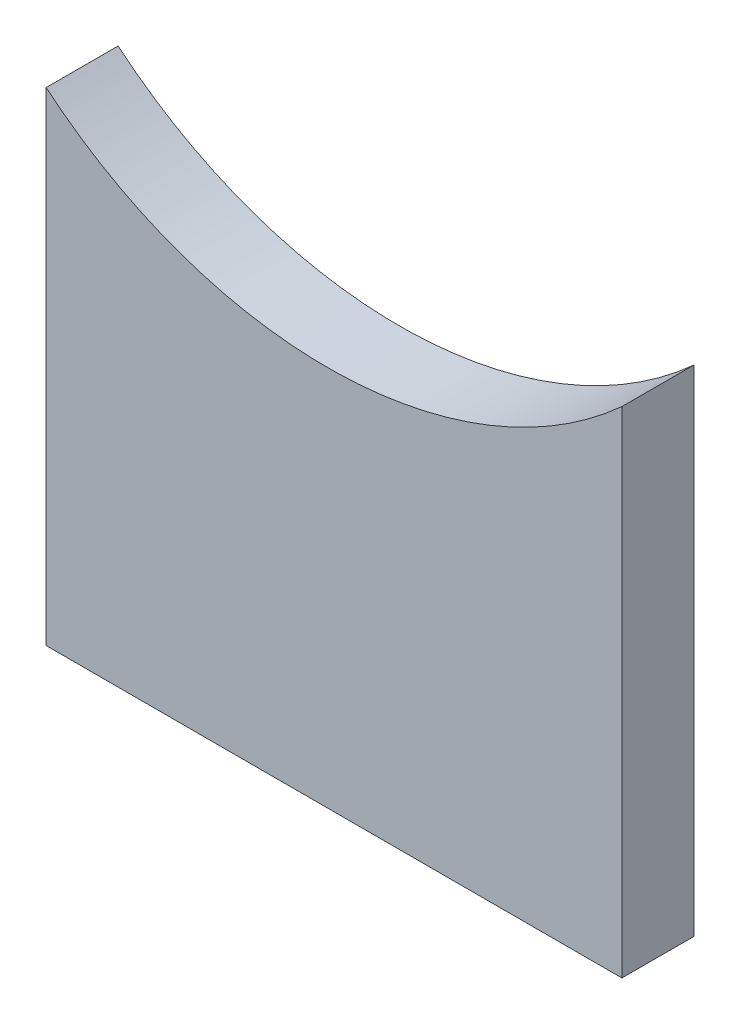
ISO-10303-21;
HEADER;
FILE_DESCRIPTION(('STEP AP214'),'2;1');
FILE_NAME('part.step','',(''),(''),'','','');
FILE_SCHEMA(('AUTOMOTIVE_DESIGN { 1 0 10303 214 1 1 1 1 }'));
ENDSEC;
DATA;
#1=APPLICATION_CONTEXT('core data for automotive mechanical design processes');
#2=APPLICATION_PROTOCOL_DEFINITION('international standard','automotive_design',2000,#1);
#3=PRODUCT_CONTEXT('',#1,'mechanical');
#4=PRODUCT('Part','Part','',(#3));
#5=PRODUCT_RELATED_PRODUCT_CATEGORY('part','',(#4));
#6=PRODUCT_DEFINITION_FORMATION('','',#4);
#7=PRODUCT_DEFINITION_CONTEXT('part definition',#1,'design');
#8=PRODUCT_DEFINITION('design','',#6,#7);
#9=PRODUCT_DEFINITION_SHAPE('','',#8);
#10=(LENGTH_UNIT() NAMED_UNIT(*) SI_UNIT(.MILLI.,.METRE.));
#11=(NAMED_UNIT(*) PLANE_ANGLE_UNIT() SI_UNIT($,.RADIAN.));
#12=(NAMED_UNIT(*) SI_UNIT($,.STERADIAN.) SOLID_ANGLE_UNIT());
#13=UNCERTAINTY_MEASURE_WITH_UNIT(LENGTH_MEASURE(1.E-05),#10,'distance_accuracy_value','');
#14=(GEOMETRIC_REPRESENTATION_CONTEXT(3) GLOBAL_UNCERTAINTY_ASSIGNED_CONTEXT((#13)) GLOBAL_UNIT_ASSIGNED_CONTEXT((#10,
#11,#12)) REPRESENTATION_CONTEXT('',''));
#15=CARTESIAN_POINT('',(0.,0.,0.));
#16=DIRECTION('',(0.,0.,1.));
#17=DIRECTION('',(1.,0.,0.));
#18=AXIS2_PLACEMENT_3D('',#15,#16,#17);
#19=CARTESIAN_POINT('',(-6.29704621779584E-13,0.,2.));
#20=DIRECTION('',(1.,0.,0.));
#21=DIRECTION('',(0.,1.,0.));
#22=AXIS2_PLACEMENT_3D('',#19,#20,#21);
#23=PLANE('',#22);
#24=DIRECTION('',(0.,-1.,0.));
#25=VECTOR('',#24,1.);
#26=CARTESIAN_POINT('',(-6.29704621779584E-13,0.,2.));
#27=LINE('',#26,#25);
#28=CARTESIAN_POINT('',(0.,18.4278674209496,2.));
#29=VERTEX_POINT('',#28);
#30=CARTESIAN_POINT('',(-6.22625392466679E-13,4.99999999999808,2.));
#31=VERTEX_POINT('',#30);
#32=EDGE_CURVE('E83',#29,#31,#27,.T.);
#33=ORIENTED_EDGE('',*,*,#32,.F.);
#34=DIRECTION('',(0.,0.,-1.));
#35=VECTOR('',#34,1.);
#36=CARTESIAN_POINT('',(0.,18.4278674209496,10.));
#37=LINE('',#36,#35);
#38=CARTESIAN_POINT('',(0.,18.4278674209496,0.));
#39=VERTEX_POINT('',#38);
#40=EDGE_CURVE('E76',#29,#39,#37,.T.);
#41=ORIENTED_EDGE('',*,*,#40,.T.);
#42=DIRECTION('',(0.,-1.,0.));
#43=VECTOR('',#42,1.);
#44=CARTESIAN_POINT('',(-6.29704621779584E-13,0.,0.));
#45=LINE('',#44,#43);
#46=CARTESIAN_POINT('',(-6.22625392466679E-13,4.99999999999808,0.));
#47=VERTEX_POINT('',#46);
#48=EDGE_CURVE('E58',#39,#47,#45,.T.);
#49=ORIENTED_EDGE('',*,*,#48,.T.);
#50=DIRECTION('',(0.,0.,1.));
#51=VECTOR('',#50,1.);
#52=CARTESIAN_POINT('',(-6.22625392466679E-13,4.99999999999808,-3.));
#53=LINE('',#52,#51);
#54=EDGE_CURVE('E91',#47,#31,#53,.T.);
#55=ORIENTED_EDGE('',*,*,#54,.T.);
#56=EDGE_LOOP('',(#33,#41,#49,#55));
#57=FACE_BOUND('',#56,.T.);
#58=ADVANCED_FACE('F36',(#57),#23,.F.);
#59=CARTESIAN_POINT('',(15.9999999999994,0.,2.));
#60=DIRECTION('',(-1.,0.,0.));
#61=DIRECTION('',(0.,-1.,0.));
#62=AXIS2_PLACEMENT_3D('',#59,#60,#61);
#63=PLANE('',#62);
#64=DIRECTION('',(0.,1.,0.));
#65=VECTOR('',#64,1.);
#66=CARTESIAN_POINT('',(15.9999999999994,0.,0.));
#67=LINE('',#66,#65);
#68=CARTESIAN_POINT('',(15.9999999999994,4.99999999999808,0.));
#69=VERTEX_POINT('',#68);
#70=CARTESIAN_POINT('',(15.9999999999994,18.7508860734117,0.));
#71=VERTEX_POINT('',#70);
#72=EDGE_CURVE('E88',#69,#71,#67,.T.);
#73=ORIENTED_EDGE('',*,*,#72,.T.);
#74=DIRECTION('',(0.,0.,-1.));
#75=VECTOR('',#74,1.);
#76=CARTESIAN_POINT('',(15.9999999999994,18.7508860734117,10.));
#77=LINE('',#76,#75);
#78=CARTESIAN_POINT('',(15.9999999999994,18.7508860734117,2.));
#79=VERTEX_POINT('',#78);
#80=EDGE_CURVE('E50',#79,#71,#77,.T.);
#81=ORIENTED_EDGE('',*,*,#80,.F.);
#82=DIRECTION('',(0.,1.,0.));
#83=VECTOR('',#82,1.);
#84=CARTESIAN_POINT('',(15.9999999999994,0.,2.));
#85=LINE('',#84,#83);
#86=CARTESIAN_POINT('',(15.9999999999994,4.99999999999808,2.));
#87=VERTEX_POINT('',#86);
#88=EDGE_CURVE('E43',#87,#79,#85,.T.);
#89=ORIENTED_EDGE('',*,*,#88,.F.);
#90=DIRECTION('',(0.,0.,1.));
#91=VECTOR('',#90,1.);
#92=CARTESIAN_POINT('',(15.9999999999994,4.99999999999808,-3.));
#93=LINE('',#92,#91);
#94=EDGE_CURVE('E89',#69,#87,#93,.T.);
#95=ORIENTED_EDGE('',*,*,#94,.F.);
#96=EDGE_LOOP('',(#73,#81,#89,#95));
#97=FACE_BOUND('',#96,.T.);
#98=ADVANCED_FACE('F105',(#97),#63,.F.);
#99=CARTESIAN_POINT('',(0.,0.,2.));
#100=DIRECTION('',(0.,0.,1.));
#101=DIRECTION('',(1.,0.,0.));
#102=AXIS2_PLACEMENT_3D('',#99,#100,#101);
#103=PLANE('',#102);
#104=CARTESIAN_POINT('',(7.81387807565871,27.8085062517981,2.));
#105=DIRECTION('',(0.,0.,1.));
#106=DIRECTION('',(1.,0.,0.));
#107=AXIS2_PLACEMENT_3D('',#104,#105,#106);
#108=CIRCLE('',#107,12.2087294775535);
#109=EDGE_CURVE('E84',#29,#79,#108,.T.);
#110=ORIENTED_EDGE('',*,*,#109,.F.);
#111=ORIENTED_EDGE('',*,*,#32,.T.);
#112=DIRECTION('',(1.,0.,0.));
#113=VECTOR('',#112,1.);
#114=CARTESIAN_POINT('',(0.,4.99999999999808,2.));
#115=LINE('',#114,#113);
#116=EDGE_CURVE('E97',#31,#87,#115,.T.);
#117=ORIENTED_EDGE('',*,*,#116,.T.);
#118=ORIENTED_EDGE('',*,*,#88,.T.);
#119=EDGE_LOOP('',(#110,#111,#117,#118));
#120=FACE_BOUND('',#119,.T.);
#121=ADVANCED_FACE('F107',(#120),#103,.T.);
#122=CARTESIAN_POINT('',(0.,0.,0.));
#123=DIRECTION('',(0.,0.,1.));
#124=DIRECTION('',(1.,0.,0.));
#125=AXIS2_PLACEMENT_3D('',#122,#123,#124);
#126=PLANE('',#125);
#127=ORIENTED_EDGE('',*,*,#48,.F.);
#128=CARTESIAN_POINT('',(7.81387807565871,27.8085062517981,0.));
#129=DIRECTION('',(0.,0.,-1.));
#130=DIRECTION('',(1.,0.,0.));
#131=AXIS2_PLACEMENT_3D('',#128,#129,#130);
#132=CIRCLE('',#131,12.2087294775535);
#133=EDGE_CURVE('E74',#71,#39,#132,.T.);
#134=ORIENTED_EDGE('',*,*,#133,.F.);
#135=ORIENTED_EDGE('',*,*,#72,.F.);
#136=DIRECTION('',(1.,0.,0.));
#137=VECTOR('',#136,1.);
#138=CARTESIAN_POINT('',(0.,4.99999999999808,0.));
#139=LINE('',#138,#137);
#140=EDGE_CURVE('E11',#47,#69,#139,.T.);
#141=ORIENTED_EDGE('',*,*,#140,.F.);
#142=EDGE_LOOP('',(#127,#134,#135,#141));
#143=FACE_BOUND('',#142,.T.);
#144=ADVANCED_FACE('F87',(#143),#126,.F.);
#145=CARTESIAN_POINT('',(0.,4.99999999999808,-3.));
#146=DIRECTION('',(0.,-1.,0.));
#147=DIRECTION('',(0.,0.,-1.));
#148=AXIS2_PLACEMENT_3D('',#145,#146,#147);
#149=PLANE('',#148);
#150=ORIENTED_EDGE('',*,*,#140,.T.);
#151=ORIENTED_EDGE('',*,*,#94,.T.);
#152=ORIENTED_EDGE('',*,*,#116,.F.);
#153=ORIENTED_EDGE('',*,*,#54,.F.);
#154=EDGE_LOOP('',(#150,#151,#152,#153));
#155=FACE_BOUND('',#154,.T.);
#156=ADVANCED_FACE('F110',(#155),#149,.T.);
#157=CARTESIAN_POINT('',(7.81387807565871,27.8085062517981,10.));
#158=DIRECTION('',(0.,0.,-1.));
#159=DIRECTION('',(-1.,0.,0.));
#160=AXIS2_PLACEMENT_3D('',#157,#158,#159);
#161=CYLINDRICAL_SURFACE('',#160,12.2087294775535);
#162=ORIENTED_EDGE('',*,*,#109,.T.);
#163=ORIENTED_EDGE('',*,*,#80,.T.);
#164=ORIENTED_EDGE('',*,*,#133,.T.);
#165=ORIENTED_EDGE('',*,*,#40,.F.);
#166=EDGE_LOOP('',(#162,#163,#164,#165));
#167=FACE_BOUND('',#166,.T.);
#168=ADVANCED_FACE('F75',(#167),#161,.F.);
#169=CLOSED_SHELL('',(#58,#98,#121,#144,#156,#168));
#170=MANIFOLD_SOLID_BREP('B2',#169);
#171=ADVANCED_BREP_SHAPE_REPRESENTATION('',(#18,#170),#14);
#172=SHAPE_DEFINITION_REPRESENTATION(#9,#171);
ENDSEC;
END-ISO-10303-21;
